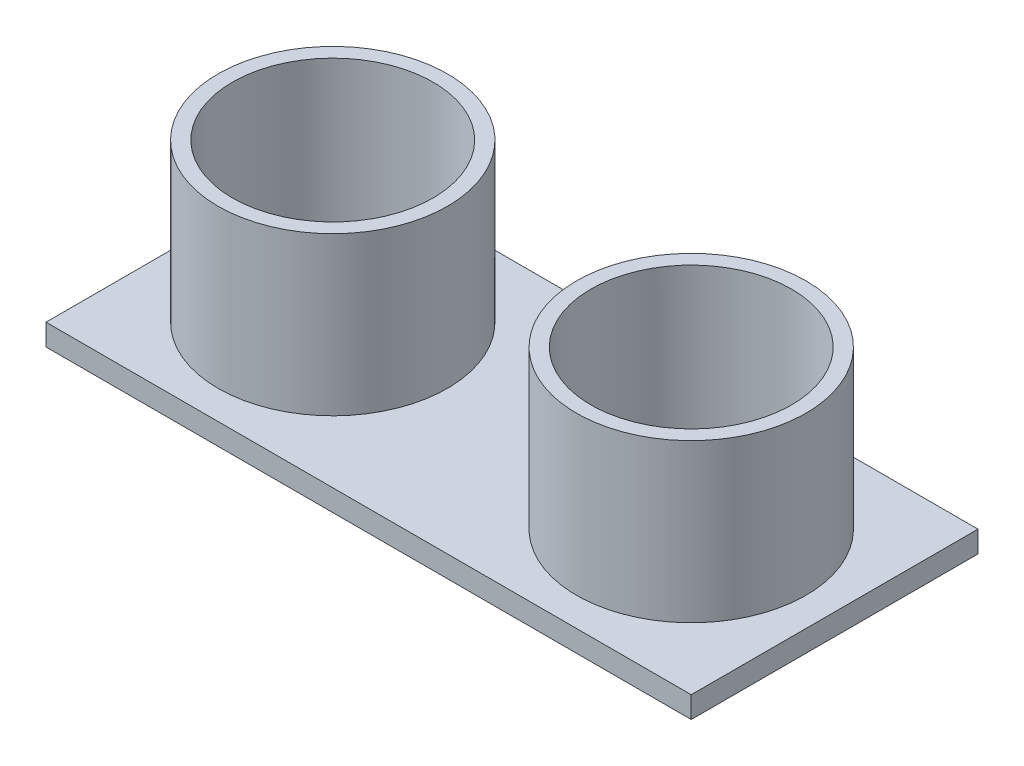
ISO-10303-21;
HEADER;
FILE_DESCRIPTION(('STEP AP214'),'2;1');
FILE_NAME('part.step','',(''),(''),'','','');
FILE_SCHEMA(('AUTOMOTIVE_DESIGN { 1 0 10303 214 1 1 1 1 }'));
ENDSEC;
DATA;
#1=APPLICATION_CONTEXT('core data for automotive mechanical design processes');
#2=APPLICATION_PROTOCOL_DEFINITION('international standard','automotive_design',2000,#1);
#3=PRODUCT_CONTEXT('',#1,'mechanical');
#4=PRODUCT('Part','Part','',(#3));
#5=PRODUCT_RELATED_PRODUCT_CATEGORY('part','',(#4));
#6=PRODUCT_DEFINITION_FORMATION('','',#4);
#7=PRODUCT_DEFINITION_CONTEXT('part definition',#1,'design');
#8=PRODUCT_DEFINITION('design','',#6,#7);
#9=PRODUCT_DEFINITION_SHAPE('','',#8);
#10=(LENGTH_UNIT() NAMED_UNIT(*) SI_UNIT(.MILLI.,.METRE.));
#11=(NAMED_UNIT(*) PLANE_ANGLE_UNIT() SI_UNIT($,.RADIAN.));
#12=(NAMED_UNIT(*) SI_UNIT($,.STERADIAN.) SOLID_ANGLE_UNIT());
#13=UNCERTAINTY_MEASURE_WITH_UNIT(LENGTH_MEASURE(1.E-05),#10,'distance_accuracy_value','');
#14=(GEOMETRIC_REPRESENTATION_CONTEXT(3) GLOBAL_UNCERTAINTY_ASSIGNED_CONTEXT((#13)) GLOBAL_UNIT_ASSIGNED_CONTEXT((#10,
#11,#12)) REPRESENTATION_CONTEXT('',''));
#15=CARTESIAN_POINT('',(0.,0.,0.));
#16=DIRECTION('',(0.,0.,1.));
#17=DIRECTION('',(1.,0.,0.));
#18=AXIS2_PLACEMENT_3D('',#15,#16,#17);
#19=CARTESIAN_POINT('',(-22.5,1.5,-10.));
#20=DIRECTION('',(0.,1.,0.));
#21=DIRECTION('',(0.,0.,1.));
#22=AXIS2_PLACEMENT_3D('',#19,#20,#21);
#23=PLANE('',#22);
#24=DIRECTION('',(0.,0.,1.));
#25=VECTOR('',#24,1.);
#26=CARTESIAN_POINT('',(-22.5,1.5,10.));
#27=LINE('',#26,#25);
#28=CARTESIAN_POINT('',(-22.5,1.5,-10.));
#29=VERTEX_POINT('',#28);
#30=CARTESIAN_POINT('',(-22.5,1.5,10.));
#31=VERTEX_POINT('',#30);
#32=EDGE_CURVE('E86',#29,#31,#27,.T.);
#33=ORIENTED_EDGE('',*,*,#32,.T.);
#34=DIRECTION('',(1.,0.,0.));
#35=VECTOR('',#34,1.);
#36=CARTESIAN_POINT('',(22.5,1.5,10.));
#37=LINE('',#36,#35);
#38=CARTESIAN_POINT('',(22.5,1.5,10.));
#39=VERTEX_POINT('',#38);
#40=EDGE_CURVE('E81',#31,#39,#37,.T.);
#41=ORIENTED_EDGE('',*,*,#40,.T.);
#42=DIRECTION('',(0.,0.,-1.));
#43=VECTOR('',#42,1.);
#44=CARTESIAN_POINT('',(22.5,1.5,10.));
#45=LINE('',#44,#43);
#46=CARTESIAN_POINT('',(22.5,1.5,-10.));
#47=VERTEX_POINT('',#46);
#48=EDGE_CURVE('E84',#39,#47,#45,.T.);
#49=ORIENTED_EDGE('',*,*,#48,.T.);
#50=DIRECTION('',(-1.,0.,0.));
#51=VECTOR('',#50,1.);
#52=CARTESIAN_POINT('',(22.5,1.5,-10.));
#53=LINE('',#52,#51);
#54=EDGE_CURVE('E50',#47,#29,#53,.T.);
#55=ORIENTED_EDGE('',*,*,#54,.T.);
#56=EDGE_LOOP('',(#33,#41,#49,#55));
#57=FACE_BOUND('',#56,.T.);
#58=CARTESIAN_POINT('',(-12.5,1.5,0.));
#59=DIRECTION('',(0.,1.,0.));
#60=DIRECTION('',(0.,0.,1.));
#61=AXIS2_PLACEMENT_3D('',#58,#59,#60);
#62=CIRCLE('',#61,8.);
#63=CARTESIAN_POINT('',(-12.5,1.5,8.));
#64=VERTEX_POINT('',#63);
#65=EDGE_CURVE('E163',#64,#64,#62,.T.);
#66=ORIENTED_EDGE('',*,*,#65,.F.);
#67=EDGE_LOOP('',(#66));
#68=FACE_BOUND('',#67,.T.);
#69=CARTESIAN_POINT('',(12.5,1.5,0.));
#70=DIRECTION('',(0.,1.,0.));
#71=DIRECTION('',(0.,0.,-1.));
#72=AXIS2_PLACEMENT_3D('',#69,#70,#71);
#73=CIRCLE('',#72,8.);
#74=CARTESIAN_POINT('',(12.5,1.5,-7.99999999999999));
#75=VERTEX_POINT('',#74);
#76=EDGE_CURVE('E171',#75,#75,#73,.T.);
#77=ORIENTED_EDGE('',*,*,#76,.F.);
#78=EDGE_LOOP('',(#77));
#79=FACE_BOUND('',#78,.T.);
#80=ADVANCED_FACE('F33',(#57,#68,#79),#23,.T.);
#81=CARTESIAN_POINT('',(-22.5,1.5,10.));
#82=DIRECTION('',(1.,0.,0.));
#83=DIRECTION('',(0.,0.,-1.));
#84=AXIS2_PLACEMENT_3D('',#81,#82,#83);
#85=PLANE('',#84);
#86=DIRECTION('',(0.,0.,1.));
#87=VECTOR('',#86,1.);
#88=CARTESIAN_POINT('',(-22.5,0.,10.));
#89=LINE('',#88,#87);
#90=CARTESIAN_POINT('',(-22.5,0.,-10.));
#91=VERTEX_POINT('',#90);
#92=CARTESIAN_POINT('',(-22.5,0.,10.));
#93=VERTEX_POINT('',#92);
#94=EDGE_CURVE('E101',#91,#93,#89,.T.);
#95=ORIENTED_EDGE('',*,*,#94,.T.);
#96=DIRECTION('',(0.,-1.,0.));
#97=VECTOR('',#96,1.);
#98=CARTESIAN_POINT('',(-22.5,1.5,10.));
#99=LINE('',#98,#97);
#100=EDGE_CURVE('E92',#31,#93,#99,.T.);
#101=ORIENTED_EDGE('',*,*,#100,.F.);
#102=ORIENTED_EDGE('',*,*,#32,.F.);
#103=DIRECTION('',(0.,-1.,0.));
#104=VECTOR('',#103,1.);
#105=CARTESIAN_POINT('',(-22.5,1.5,-10.));
#106=LINE('',#105,#104);
#107=EDGE_CURVE('E97',#29,#91,#106,.T.);
#108=ORIENTED_EDGE('',*,*,#107,.T.);
#109=EDGE_LOOP('',(#95,#101,#102,#108));
#110=FACE_BOUND('',#109,.T.);
#111=ADVANCED_FACE('F35',(#110),#85,.F.);
#112=CARTESIAN_POINT('',(22.5,1.5,10.));
#113=DIRECTION('',(0.,0.,-1.));
#114=DIRECTION('',(-1.,0.,0.));
#115=AXIS2_PLACEMENT_3D('',#112,#113,#114);
#116=PLANE('',#115);
#117=DIRECTION('',(1.,0.,0.));
#118=VECTOR('',#117,1.);
#119=CARTESIAN_POINT('',(22.5,0.,10.));
#120=LINE('',#119,#118);
#121=CARTESIAN_POINT('',(22.5,0.,10.));
#122=VERTEX_POINT('',#121);
#123=EDGE_CURVE('E91',#93,#122,#120,.T.);
#124=ORIENTED_EDGE('',*,*,#123,.T.);
#125=DIRECTION('',(0.,-1.,0.));
#126=VECTOR('',#125,1.);
#127=CARTESIAN_POINT('',(22.5,1.5,10.));
#128=LINE('',#127,#126);
#129=EDGE_CURVE('E89',#39,#122,#128,.T.);
#130=ORIENTED_EDGE('',*,*,#129,.F.);
#131=ORIENTED_EDGE('',*,*,#40,.F.);
#132=ORIENTED_EDGE('',*,*,#100,.T.);
#133=EDGE_LOOP('',(#124,#130,#131,#132));
#134=FACE_BOUND('',#133,.T.);
#135=ADVANCED_FACE('F90',(#134),#116,.F.);
#136=CARTESIAN_POINT('',(22.5,1.5,10.));
#137=DIRECTION('',(-1.,0.,0.));
#138=DIRECTION('',(0.,0.,1.));
#139=AXIS2_PLACEMENT_3D('',#136,#137,#138);
#140=PLANE('',#139);
#141=DIRECTION('',(0.,0.,-1.));
#142=VECTOR('',#141,1.);
#143=CARTESIAN_POINT('',(22.5,0.,10.));
#144=LINE('',#143,#142);
#145=CARTESIAN_POINT('',(22.5,0.,-10.));
#146=VERTEX_POINT('',#145);
#147=EDGE_CURVE('E67',#122,#146,#144,.T.);
#148=ORIENTED_EDGE('',*,*,#147,.T.);
#149=DIRECTION('',(0.,-1.,0.));
#150=VECTOR('',#149,1.);
#151=CARTESIAN_POINT('',(22.5,1.5,-10.));
#152=LINE('',#151,#150);
#153=EDGE_CURVE('E93',#47,#146,#152,.T.);
#154=ORIENTED_EDGE('',*,*,#153,.F.);
#155=ORIENTED_EDGE('',*,*,#48,.F.);
#156=ORIENTED_EDGE('',*,*,#129,.T.);
#157=EDGE_LOOP('',(#148,#154,#155,#156));
#158=FACE_BOUND('',#157,.T.);
#159=ADVANCED_FACE('F95',(#158),#140,.F.);
#160=CARTESIAN_POINT('',(22.5,1.5,-10.));
#161=DIRECTION('',(0.,0.,1.));
#162=DIRECTION('',(1.,0.,0.));
#163=AXIS2_PLACEMENT_3D('',#160,#161,#162);
#164=PLANE('',#163);
#165=DIRECTION('',(-1.,0.,0.));
#166=VECTOR('',#165,1.);
#167=CARTESIAN_POINT('',(22.5,0.,-10.));
#168=LINE('',#167,#166);
#169=EDGE_CURVE('E73',#146,#91,#168,.T.);
#170=ORIENTED_EDGE('',*,*,#169,.T.);
#171=ORIENTED_EDGE('',*,*,#107,.F.);
#172=ORIENTED_EDGE('',*,*,#54,.F.);
#173=ORIENTED_EDGE('',*,*,#153,.T.);
#174=EDGE_LOOP('',(#170,#171,#172,#173));
#175=FACE_BOUND('',#174,.T.);
#176=ADVANCED_FACE('F240',(#175),#164,.F.);
#177=CARTESIAN_POINT('',(-22.5,0.,-10.));
#178=DIRECTION('',(0.,1.,0.));
#179=DIRECTION('',(0.,0.,1.));
#180=AXIS2_PLACEMENT_3D('',#177,#178,#179);
#181=PLANE('',#180);
#182=ORIENTED_EDGE('',*,*,#94,.F.);
#183=ORIENTED_EDGE('',*,*,#169,.F.);
#184=ORIENTED_EDGE('',*,*,#147,.F.);
#185=ORIENTED_EDGE('',*,*,#123,.F.);
#186=EDGE_LOOP('',(#182,#183,#184,#185));
#187=FACE_BOUND('',#186,.T.);
#188=ADVANCED_FACE('F152',(#187),#181,.F.);
#189=CARTESIAN_POINT('',(-12.5,12.5,0.));
#190=DIRECTION('',(0.,1.,0.));
#191=DIRECTION('',(0.,0.,1.));
#192=AXIS2_PLACEMENT_3D('',#189,#190,#191);
#193=PLANE('',#192);
#194=CARTESIAN_POINT('',(-12.5,12.5,0.));
#195=DIRECTION('',(0.,1.,0.));
#196=DIRECTION('',(0.,0.,1.));
#197=AXIS2_PLACEMENT_3D('',#194,#195,#196);
#198=CIRCLE('',#197,8.);
#199=CARTESIAN_POINT('',(-12.5,12.5,8.));
#200=VERTEX_POINT('',#199);
#201=EDGE_CURVE('E104',#200,#200,#198,.T.);
#202=ORIENTED_EDGE('',*,*,#201,.T.);
#203=EDGE_LOOP('',(#202));
#204=FACE_BOUND('',#203,.T.);
#205=CARTESIAN_POINT('',(-12.5,12.5,0.));
#206=DIRECTION('',(0.,1.,0.));
#207=DIRECTION('',(0.,0.,1.));
#208=AXIS2_PLACEMENT_3D('',#205,#206,#207);
#209=CIRCLE('',#208,7.);
#210=CARTESIAN_POINT('',(-12.5,12.5,7.));
#211=VERTEX_POINT('',#210);
#212=EDGE_CURVE('E164',#211,#211,#209,.T.);
#213=ORIENTED_EDGE('',*,*,#212,.F.);
#214=EDGE_LOOP('',(#213));
#215=FACE_BOUND('',#214,.T.);
#216=ADVANCED_FACE('F150',(#204,#215),#193,.T.);
#217=CARTESIAN_POINT('',(-12.5,12.5,0.));
#218=DIRECTION('',(0.,-1.,0.));
#219=DIRECTION('',(0.,0.,-1.));
#220=AXIS2_PLACEMENT_3D('',#217,#218,#219);
#221=CYLINDRICAL_SURFACE('',#220,8.);
#222=ORIENTED_EDGE('',*,*,#201,.F.);
#223=EDGE_LOOP('',(#222));
#224=FACE_BOUND('',#223,.T.);
#225=ORIENTED_EDGE('',*,*,#65,.T.);
#226=EDGE_LOOP('',(#225));
#227=FACE_BOUND('',#226,.T.);
#228=ADVANCED_FACE('F127',(#224,#227),#221,.T.);
#229=CARTESIAN_POINT('',(-12.5,12.5,0.));
#230=DIRECTION('',(0.,-1.,0.));
#231=DIRECTION('',(0.,0.,-1.));
#232=AXIS2_PLACEMENT_3D('',#229,#230,#231);
#233=CYLINDRICAL_SURFACE('',#232,7.);
#234=ORIENTED_EDGE('',*,*,#212,.T.);
#235=EDGE_LOOP('',(#234));
#236=FACE_BOUND('',#235,.T.);
#237=CARTESIAN_POINT('',(-12.5,1.5,0.));
#238=DIRECTION('',(0.,1.,0.));
#239=DIRECTION('',(0.,0.,1.));
#240=AXIS2_PLACEMENT_3D('',#237,#238,#239);
#241=CIRCLE('',#240,7.);
#242=CARTESIAN_POINT('',(-12.5,1.5,7.));
#243=VERTEX_POINT('',#242);
#244=EDGE_CURVE('E42',#243,#243,#241,.F.);
#245=ORIENTED_EDGE('',*,*,#244,.T.);
#246=EDGE_LOOP('',(#245));
#247=FACE_BOUND('',#246,.T.);
#248=ADVANCED_FACE('F113',(#236,#247),#233,.F.);
#249=ORIENTED_EDGE('',*,*,#244,.F.);
#250=EDGE_LOOP('',(#249));
#251=FACE_BOUND('',#250,.T.);
#252=ADVANCED_FACE('F115',(#251),#23,.T.);
#253=CARTESIAN_POINT('',(12.5,12.5,0.));
#254=DIRECTION('',(0.,-1.,0.));
#255=DIRECTION('',(0.,0.,-1.));
#256=AXIS2_PLACEMENT_3D('',#253,#254,#255);
#257=PLANE('',#256);
#258=CARTESIAN_POINT('',(12.5,12.5,0.));
#259=DIRECTION('',(0.,1.,0.));
#260=DIRECTION('',(0.,0.,-1.));
#261=AXIS2_PLACEMENT_3D('',#258,#259,#260);
#262=CIRCLE('',#261,8.);
#263=CARTESIAN_POINT('',(12.5,12.5,-7.99999999999999));
#264=VERTEX_POINT('',#263);
#265=EDGE_CURVE('E168',#264,#264,#262,.T.);
#266=ORIENTED_EDGE('',*,*,#265,.T.);
#267=EDGE_LOOP('',(#266));
#268=FACE_BOUND('',#267,.T.);
#269=CARTESIAN_POINT('',(12.5,12.5,0.));
#270=DIRECTION('',(0.,1.,0.));
#271=DIRECTION('',(0.,0.,-1.));
#272=AXIS2_PLACEMENT_3D('',#269,#270,#271);
#273=CIRCLE('',#272,7.);
#274=CARTESIAN_POINT('',(12.5,12.5,-6.99999999999998));
#275=VERTEX_POINT('',#274);
#276=EDGE_CURVE('E174',#275,#275,#273,.T.);
#277=ORIENTED_EDGE('',*,*,#276,.F.);
#278=EDGE_LOOP('',(#277));
#279=FACE_BOUND('',#278,.T.);
#280=ADVANCED_FACE('F117',(#268,#279),#257,.F.);
#281=CARTESIAN_POINT('',(12.5,12.5,0.));
#282=DIRECTION('',(0.,-1.,0.));
#283=DIRECTION('',(0.,0.,-1.));
#284=AXIS2_PLACEMENT_3D('',#281,#282,#283);
#285=CYLINDRICAL_SURFACE('',#284,8.);
#286=ORIENTED_EDGE('',*,*,#265,.F.);
#287=EDGE_LOOP('',(#286));
#288=FACE_BOUND('',#287,.T.);
#289=ORIENTED_EDGE('',*,*,#76,.T.);
#290=EDGE_LOOP('',(#289));
#291=FACE_BOUND('',#290,.T.);
#292=ADVANCED_FACE('F124',(#288,#291),#285,.T.);
#293=CARTESIAN_POINT('',(12.5,12.5,0.));
#294=DIRECTION('',(0.,-1.,0.));
#295=DIRECTION('',(0.,0.,-1.));
#296=AXIS2_PLACEMENT_3D('',#293,#294,#295);
#297=CYLINDRICAL_SURFACE('',#296,7.);
#298=ORIENTED_EDGE('',*,*,#276,.T.);
#299=EDGE_LOOP('',(#298));
#300=FACE_BOUND('',#299,.T.);
#301=CARTESIAN_POINT('',(12.5,1.5,0.));
#302=DIRECTION('',(0.,1.,0.));
#303=DIRECTION('',(0.,0.,1.));
#304=AXIS2_PLACEMENT_3D('',#301,#302,#303);
#305=CIRCLE('',#304,7.);
#306=CARTESIAN_POINT('',(12.5,1.5,7.00000000000002));
#307=VERTEX_POINT('',#306);
#308=EDGE_CURVE('E11',#307,#307,#305,.F.);
#309=ORIENTED_EDGE('',*,*,#308,.T.);
#310=EDGE_LOOP('',(#309));
#311=FACE_BOUND('',#310,.T.);
#312=ADVANCED_FACE('F134',(#300,#311),#297,.F.);
#313=ORIENTED_EDGE('',*,*,#308,.F.);
#314=EDGE_LOOP('',(#313));
#315=FACE_BOUND('',#314,.T.);
#316=ADVANCED_FACE('F119',(#315),#23,.T.);
#317=CLOSED_SHELL('',(#80,#111,#135,#159,#176,#188,#216,#228,#248,#252,#280,#292,#312,#316));
#318=MANIFOLD_SOLID_BREP('B2',#317);
#319=ADVANCED_BREP_SHAPE_REPRESENTATION('',(#18,#318),#14);
#320=SHAPE_DEFINITION_REPRESENTATION(#9,#319);
ENDSEC;
END-ISO-10303-21;
